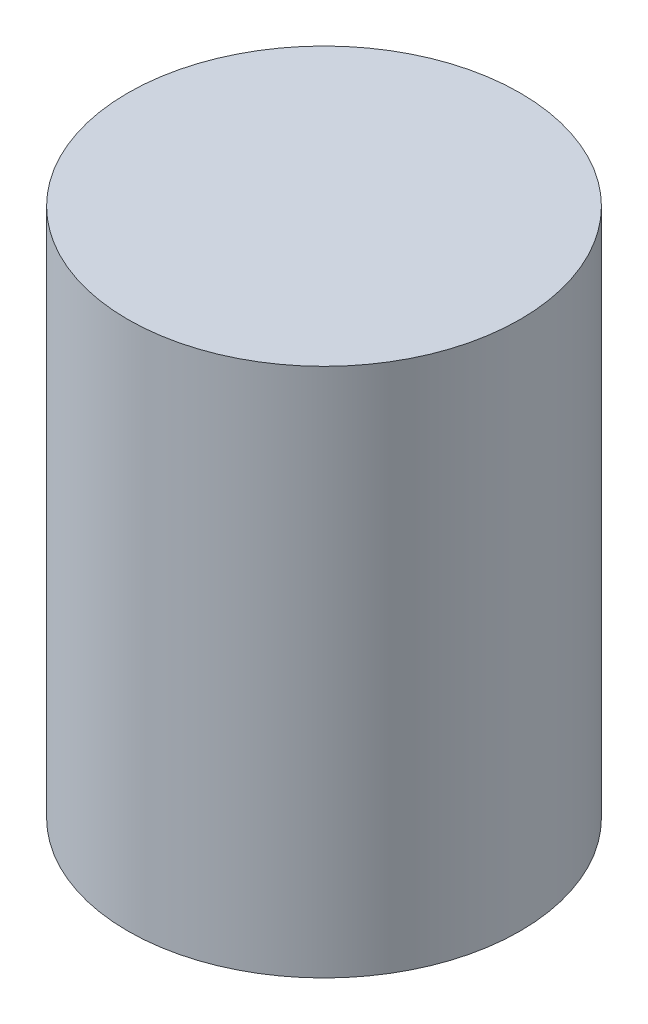
ISO-10303-21;
HEADER;
FILE_DESCRIPTION(('STEP AP214'),'2;1');
FILE_NAME('part.step','',(''),(''),'','','');
FILE_SCHEMA(('AUTOMOTIVE_DESIGN { 1 0 10303 214 1 1 1 1 }'));
ENDSEC;
DATA;
#1=APPLICATION_CONTEXT('core data for automotive mechanical design processes');
#2=APPLICATION_PROTOCOL_DEFINITION('international standard','automotive_design',2000,#1);
#3=PRODUCT_CONTEXT('',#1,'mechanical');
#4=PRODUCT('Part','Part','',(#3));
#5=PRODUCT_RELATED_PRODUCT_CATEGORY('part','',(#4));
#6=PRODUCT_DEFINITION_FORMATION('','',#4);
#7=PRODUCT_DEFINITION_CONTEXT('part definition',#1,'design');
#8=PRODUCT_DEFINITION('design','',#6,#7);
#9=PRODUCT_DEFINITION_SHAPE('','',#8);
#10=(LENGTH_UNIT() NAMED_UNIT(*) SI_UNIT(.MILLI.,.METRE.));
#11=(NAMED_UNIT(*) PLANE_ANGLE_UNIT() SI_UNIT($,.RADIAN.));
#12=(NAMED_UNIT(*) SI_UNIT($,.STERADIAN.) SOLID_ANGLE_UNIT());
#13=UNCERTAINTY_MEASURE_WITH_UNIT(LENGTH_MEASURE(1.E-05),#10,'distance_accuracy_value','');
#14=(GEOMETRIC_REPRESENTATION_CONTEXT(3) GLOBAL_UNCERTAINTY_ASSIGNED_CONTEXT((#13)) GLOBAL_UNIT_ASSIGNED_CONTEXT((#10,
#11,#12)) REPRESENTATION_CONTEXT('',''));
#15=CARTESIAN_POINT('',(0.,0.,0.));
#16=DIRECTION('',(0.,0.,1.));
#17=DIRECTION('',(1.,0.,0.));
#18=AXIS2_PLACEMENT_3D('',#15,#16,#17);
#19=CARTESIAN_POINT('',(0.,27.,0.));
#20=DIRECTION('',(0.,-1.,0.));
#21=DIRECTION('',(0.,0.,-1.));
#22=AXIS2_PLACEMENT_3D('',#19,#20,#21);
#23=CYLINDRICAL_SURFACE('',#22,10.);
#24=CARTESIAN_POINT('',(0.,27.,0.));
#25=DIRECTION('',(0.,1.,0.));
#26=DIRECTION('',(0.,0.,1.));
#27=AXIS2_PLACEMENT_3D('',#24,#25,#26);
#28=CIRCLE('',#27,10.);
#29=CARTESIAN_POINT('',(0.,27.,10.));
#30=VERTEX_POINT('',#29);
#31=EDGE_CURVE('E10',#30,#30,#28,.T.);
#32=ORIENTED_EDGE('',*,*,#31,.F.);
#33=EDGE_LOOP('',(#32));
#34=FACE_BOUND('',#33,.T.);
#35=CARTESIAN_POINT('',(0.,0.,0.));
#36=DIRECTION('',(0.,1.,0.));
#37=DIRECTION('',(0.,0.,1.));
#38=AXIS2_PLACEMENT_3D('',#35,#36,#37);
#39=CIRCLE('',#38,10.);
#40=CARTESIAN_POINT('',(0.,0.,10.));
#41=VERTEX_POINT('',#40);
#42=EDGE_CURVE('E36',#41,#41,#39,.T.);
#43=ORIENTED_EDGE('',*,*,#42,.T.);
#44=EDGE_LOOP('',(#43));
#45=FACE_BOUND('',#44,.T.);
#46=ADVANCED_FACE('F33',(#34,#45),#23,.T.);
#47=CARTESIAN_POINT('',(0.,27.,0.));
#48=DIRECTION('',(0.,1.,0.));
#49=DIRECTION('',(0.,0.,1.));
#50=AXIS2_PLACEMENT_3D('',#47,#48,#49);
#51=PLANE('',#50);
#52=ORIENTED_EDGE('',*,*,#31,.T.);
#53=EDGE_LOOP('',(#52));
#54=FACE_BOUND('',#53,.T.);
#55=ADVANCED_FACE('F48',(#54),#51,.T.);
#56=CARTESIAN_POINT('',(0.,0.,0.));
#57=DIRECTION('',(0.,1.,0.));
#58=DIRECTION('',(0.,0.,1.));
#59=AXIS2_PLACEMENT_3D('',#56,#57,#58);
#60=PLANE('',#59);
#61=ORIENTED_EDGE('',*,*,#42,.F.);
#62=EDGE_LOOP('',(#61));
#63=FACE_BOUND('',#62,.T.);
#64=ADVANCED_FACE('F46',(#63),#60,.F.);
#65=CLOSED_SHELL('',(#46,#55,#64));
#66=MANIFOLD_SOLID_BREP('B2',#65);
#67=ADVANCED_BREP_SHAPE_REPRESENTATION('',(#18,#66),#14);
#68=SHAPE_DEFINITION_REPRESENTATION(#9,#67);
ENDSEC;
END-ISO-10303-21;
